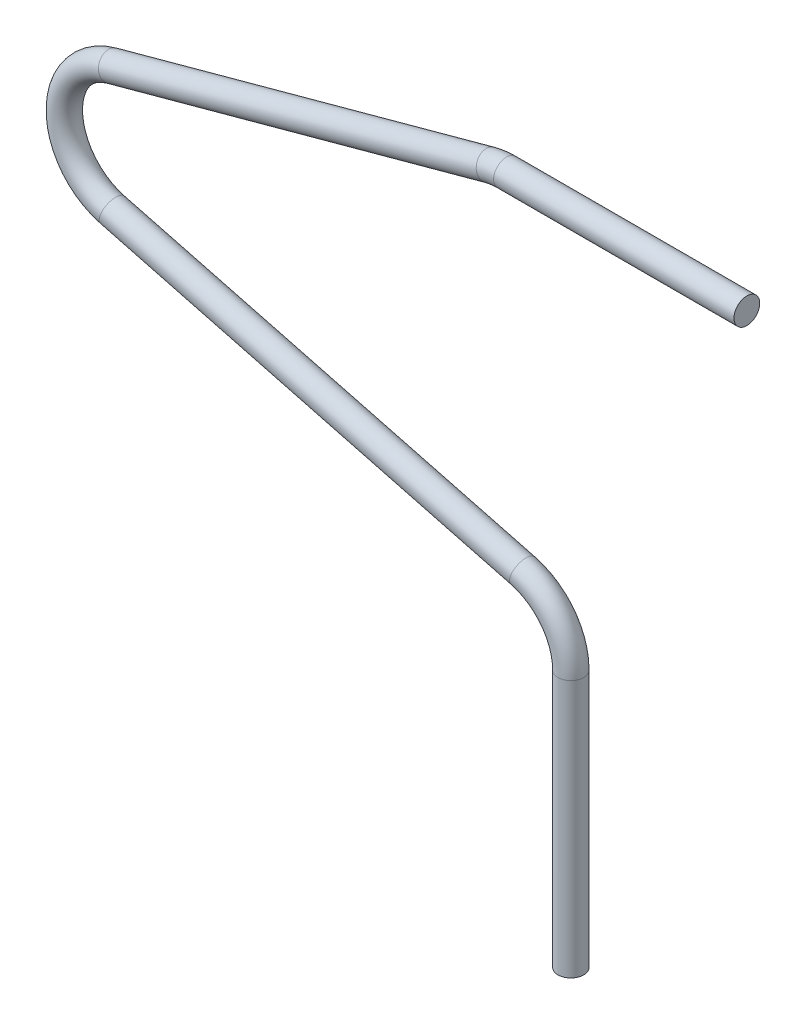
ISO-10303-21;
HEADER;
FILE_DESCRIPTION(('STEP AP214'),'2;1');
FILE_NAME('part.step','',(''),(''),'','','');
FILE_SCHEMA(('AUTOMOTIVE_DESIGN { 1 0 10303 214 1 1 1 1 }'));
ENDSEC;
DATA;
#1=APPLICATION_CONTEXT('core data for automotive mechanical design processes');
#2=APPLICATION_PROTOCOL_DEFINITION('international standard','automotive_design',2000,#1);
#3=PRODUCT_CONTEXT('',#1,'mechanical');
#4=PRODUCT('Part','Part','',(#3));
#5=PRODUCT_RELATED_PRODUCT_CATEGORY('part','',(#4));
#6=PRODUCT_DEFINITION_FORMATION('','',#4);
#7=PRODUCT_DEFINITION_CONTEXT('part definition',#1,'design');
#8=PRODUCT_DEFINITION('design','',#6,#7);
#9=PRODUCT_DEFINITION_SHAPE('','',#8);
#10=(LENGTH_UNIT() NAMED_UNIT(*) SI_UNIT(.MILLI.,.METRE.));
#11=(NAMED_UNIT(*) PLANE_ANGLE_UNIT() SI_UNIT($,.RADIAN.));
#12=(NAMED_UNIT(*) SI_UNIT($,.STERADIAN.) SOLID_ANGLE_UNIT());
#13=UNCERTAINTY_MEASURE_WITH_UNIT(LENGTH_MEASURE(1.E-05),#10,'distance_accuracy_value','');
#14=(GEOMETRIC_REPRESENTATION_CONTEXT(3) GLOBAL_UNCERTAINTY_ASSIGNED_CONTEXT((#13)) GLOBAL_UNIT_ASSIGNED_CONTEXT((#10,
#11,#12)) REPRESENTATION_CONTEXT('',''));
#15=CARTESIAN_POINT('',(0.,0.,0.));
#16=DIRECTION('',(0.,0.,1.));
#17=DIRECTION('',(1.,0.,0.));
#18=AXIS2_PLACEMENT_3D('',#15,#16,#17);
#19=CARTESIAN_POINT('',(-3.75000000000001,38.25,0.));
#20=DIRECTION('',(1.,0.,0.));
#21=DIRECTION('',(0.,0.,-1.));
#22=AXIS2_PLACEMENT_3D('',#19,#20,#21);
#23=CYLINDRICAL_SURFACE('',#22,0.75);
#24=CARTESIAN_POINT('',(-3.75000000000001,38.25,0.));
#25=DIRECTION('',(1.,0.,0.));
#26=DIRECTION('',(0.,0.,1.));
#27=AXIS2_PLACEMENT_3D('',#24,#25,#26);
#28=CIRCLE('',#27,0.75);
#29=CARTESIAN_POINT('',(-3.75000000000001,39.,0.));
#30=VERTEX_POINT('',#29);
#31=EDGE_CURVE('E38',#30,#30,#28,.T.);
#32=ORIENTED_EDGE('',*,*,#31,.T.);
#33=EDGE_LOOP('',(#32));
#34=FACE_BOUND('',#33,.T.);
#35=CARTESIAN_POINT('',(10.25,38.25,0.));
#36=DIRECTION('',(1.,0.,0.));
#37=DIRECTION('',(0.,0.,1.));
#38=AXIS2_PLACEMENT_3D('',#35,#36,#37);
#39=CIRCLE('',#38,0.75);
#40=CARTESIAN_POINT('',(10.25,38.25,0.75));
#41=VERTEX_POINT('',#40);
#42=EDGE_CURVE('E10',#41,#41,#39,.T.);
#43=ORIENTED_EDGE('',*,*,#42,.F.);
#44=EDGE_LOOP('',(#43));
#45=FACE_BOUND('',#44,.T.);
#46=ADVANCED_FACE('F32',(#34,#45),#23,.T.);
#47=CARTESIAN_POINT('',(-3.75,34.5,0.));
#48=DIRECTION('',(0.,0.,-1.));
#49=DIRECTION('',(-1.,0.,0.));
#50=AXIS2_PLACEMENT_3D('',#47,#48,#49);
#51=TOROIDAL_SURFACE('',#50,3.75000000000001,0.75);
#52=CARTESIAN_POINT('',(-4.73669027172042,38.1178643296415,0.));
#53=DIRECTION('',(0.964763821237732,0.26311740579211,0.));
#54=DIRECTION('',(0.,0.,1.));
#55=AXIS2_PLACEMENT_3D('',#52,#53,#54);
#56=CIRCLE('',#55,0.75);
#57=CARTESIAN_POINT('',(-4.9340283260645,38.8414371955698,0.));
#58=VERTEX_POINT('',#57);
#59=EDGE_CURVE('E42',#58,#58,#56,.T.);
#60=CARTESIAN_POINT('',(-3.75,34.5,0.));
#61=DIRECTION('',(0.,0.,-1.));
#62=DIRECTION('',(-1.,0.,0.));
#63=AXIS2_PLACEMENT_3D('',#60,#61,#62);
#64=CIRCLE('',#63,4.50000000000001);
#65=EDGE_CURVE('',#58,#30,#64,.T.);
#66=ORIENTED_EDGE('',*,*,#59,.T.);
#67=ORIENTED_EDGE('',*,*,#31,.F.);
#68=ORIENTED_EDGE('',*,*,#65,.T.);
#69=ORIENTED_EDGE('',*,*,#65,.F.);
#70=EDGE_LOOP('',(#66,#68,#67,#69));
#71=FACE_BOUND('',#70,.T.);
#72=ADVANCED_FACE('F82',(#71),#51,.T.);
#73=CARTESIAN_POINT('',(-26.7366902717204,32.1178643296415,0.));
#74=DIRECTION('',(0.964763821237732,0.263117405792109,0.));
#75=DIRECTION('',(-0.263117405792109,0.964763821237732,0.));
#76=AXIS2_PLACEMENT_3D('',#73,#74,#75);
#77=CYLINDRICAL_SURFACE('',#76,0.75);
#78=CARTESIAN_POINT('',(-26.7366902717204,32.1178643296415,0.));
#79=DIRECTION('',(0.964763821237732,0.26311740579211,0.));
#80=DIRECTION('',(0.,0.,1.));
#81=AXIS2_PLACEMENT_3D('',#78,#79,#80);
#82=CIRCLE('',#81,0.75);
#83=CARTESIAN_POINT('',(-26.9340283260645,32.8414371955698,0.));
#84=VERTEX_POINT('',#83);
#85=EDGE_CURVE('E46',#84,#84,#82,.T.);
#86=ORIENTED_EDGE('',*,*,#85,.T.);
#87=EDGE_LOOP('',(#86));
#88=FACE_BOUND('',#87,.T.);
#89=ORIENTED_EDGE('',*,*,#59,.F.);
#90=EDGE_LOOP('',(#89));
#91=FACE_BOUND('',#90,.T.);
#92=ADVANCED_FACE('F86',(#88,#91),#77,.T.);
#93=CARTESIAN_POINT('',(-25.75,28.5,0.));
#94=DIRECTION('',(0.,0.,-1.));
#95=DIRECTION('',(-1.,0.,0.));
#96=AXIS2_PLACEMENT_3D('',#93,#94,#95);
#97=TOROIDAL_SURFACE('',#96,3.75000000000001,0.75);
#98=CARTESIAN_POINT('',(-26.6979853880929,24.8718015897746,0.));
#99=DIRECTION('',(-0.967519576060117,0.252796103491435,0.));
#100=DIRECTION('',(0.,0.,1.));
#101=AXIS2_PLACEMENT_3D('',#98,#99,#100);
#102=CIRCLE('',#101,0.75);
#103=CARTESIAN_POINT('',(-26.8875824657115,24.1461619077295,0.));
#104=VERTEX_POINT('',#103);
#105=EDGE_CURVE('E51',#104,#104,#102,.T.);
#106=CARTESIAN_POINT('',(-25.75,28.5,0.));
#107=DIRECTION('',(0.,0.,-1.));
#108=DIRECTION('',(-1.,0.,0.));
#109=AXIS2_PLACEMENT_3D('',#106,#107,#108);
#110=CIRCLE('',#109,4.50000000000001);
#111=EDGE_CURVE('',#104,#84,#110,.T.);
#112=ORIENTED_EDGE('',*,*,#105,.T.);
#113=ORIENTED_EDGE('',*,*,#85,.F.);
#114=ORIENTED_EDGE('',*,*,#111,.T.);
#115=ORIENTED_EDGE('',*,*,#111,.F.);
#116=EDGE_LOOP('',(#112,#114,#113,#115));
#117=FACE_BOUND('',#116,.T.);
#118=ADVANCED_FACE('F92',(#117),#97,.T.);
#119=CARTESIAN_POINT('',(-2.80201461190712,18.6281984102254,0.));
#120=DIRECTION('',(-0.967519576060117,0.252796103491435,0.));
#121=DIRECTION('',(-0.252796103491435,-0.967519576060117,0.));
#122=AXIS2_PLACEMENT_3D('',#119,#120,#121);
#123=CYLINDRICAL_SURFACE('',#122,0.75);
#124=CARTESIAN_POINT('',(-2.80201461190712,18.6281984102254,0.));
#125=DIRECTION('',(-0.967519576060117,0.252796103491435,0.));
#126=DIRECTION('',(0.,0.,1.));
#127=AXIS2_PLACEMENT_3D('',#124,#125,#126);
#128=CIRCLE('',#127,0.75);
#129=CARTESIAN_POINT('',(-2.61241753428854,19.3538380922705,0.));
#130=VERTEX_POINT('',#129);
#131=EDGE_CURVE('E54',#130,#130,#128,.T.);
#132=ORIENTED_EDGE('',*,*,#131,.T.);
#133=EDGE_LOOP('',(#132));
#134=FACE_BOUND('',#133,.T.);
#135=ORIENTED_EDGE('',*,*,#105,.F.);
#136=EDGE_LOOP('',(#135));
#137=FACE_BOUND('',#136,.T.);
#138=ADVANCED_FACE('F99',(#134,#137),#123,.T.);
#139=CARTESIAN_POINT('',(-3.75,15.,0.));
#140=DIRECTION('',(0.,0.,1.));
#141=DIRECTION('',(1.,0.,0.));
#142=AXIS2_PLACEMENT_3D('',#139,#140,#141);
#143=TOROIDAL_SURFACE('',#142,3.75,0.75);
#144=CARTESIAN_POINT('',(0.,15.,0.));
#145=DIRECTION('',(0.,1.,0.));
#146=DIRECTION('',(0.,0.,1.));
#147=AXIS2_PLACEMENT_3D('',#144,#145,#146);
#148=CIRCLE('',#147,0.75);
#149=CARTESIAN_POINT('',(0.75,15.,0.));
#150=VERTEX_POINT('',#149);
#151=EDGE_CURVE('E57',#150,#150,#148,.T.);
#152=CARTESIAN_POINT('',(-3.75,15.,0.));
#153=DIRECTION('',(0.,0.,1.));
#154=DIRECTION('',(1.,0.,0.));
#155=AXIS2_PLACEMENT_3D('',#152,#153,#154);
#156=CIRCLE('',#155,4.5);
#157=EDGE_CURVE('',#150,#130,#156,.T.);
#158=ORIENTED_EDGE('',*,*,#151,.T.);
#159=ORIENTED_EDGE('',*,*,#131,.F.);
#160=ORIENTED_EDGE('',*,*,#157,.T.);
#161=ORIENTED_EDGE('',*,*,#157,.F.);
#162=EDGE_LOOP('',(#158,#160,#159,#161));
#163=FACE_BOUND('',#162,.T.);
#164=ADVANCED_FACE('F64',(#163),#143,.T.);
#165=CARTESIAN_POINT('',(0.,15.,0.));
#166=DIRECTION('',(0.,-1.,0.));
#167=DIRECTION('',(0.,0.,-1.));
#168=AXIS2_PLACEMENT_3D('',#165,#166,#167);
#169=CYLINDRICAL_SURFACE('',#168,0.75);
#170=ORIENTED_EDGE('',*,*,#151,.F.);
#171=EDGE_LOOP('',(#170));
#172=FACE_BOUND('',#171,.T.);
#173=CARTESIAN_POINT('',(0.,0.,0.));
#174=DIRECTION('',(0.,1.,0.));
#175=DIRECTION('',(0.,0.,1.));
#176=AXIS2_PLACEMENT_3D('',#173,#174,#175);
#177=CIRCLE('',#176,0.75);
#178=CARTESIAN_POINT('',(0.,0.,0.75));
#179=VERTEX_POINT('',#178);
#180=EDGE_CURVE('E58',#179,#179,#177,.T.);
#181=ORIENTED_EDGE('',*,*,#180,.T.);
#182=EDGE_LOOP('',(#181));
#183=FACE_BOUND('',#182,.T.);
#184=ADVANCED_FACE('F67',(#172,#183),#169,.T.);
#185=CARTESIAN_POINT('',(10.25,38.25,0.));
#186=DIRECTION('',(1.,0.,0.));
#187=DIRECTION('',(0.,0.,1.));
#188=AXIS2_PLACEMENT_3D('',#185,#186,#187);
#189=PLANE('',#188);
#190=ORIENTED_EDGE('',*,*,#42,.T.);
#191=EDGE_LOOP('',(#190));
#192=FACE_BOUND('',#191,.T.);
#193=ADVANCED_FACE('F70',(#192),#189,.T.);
#194=CARTESIAN_POINT('',(0.,0.,0.));
#195=DIRECTION('',(0.,1.,0.));
#196=DIRECTION('',(0.,0.,1.));
#197=AXIS2_PLACEMENT_3D('',#194,#195,#196);
#198=PLANE('',#197);
#199=ORIENTED_EDGE('',*,*,#180,.F.);
#200=EDGE_LOOP('',(#199));
#201=FACE_BOUND('',#200,.T.);
#202=ADVANCED_FACE('F74',(#201),#198,.F.);
#203=CLOSED_SHELL('',(#46,#72,#92,#118,#138,#164,#184,#193,#202));
#204=MANIFOLD_SOLID_BREP('B2',#203);
#205=ADVANCED_BREP_SHAPE_REPRESENTATION('',(#18,#204),#14);
#206=SHAPE_DEFINITION_REPRESENTATION(#9,#205);
ENDSEC;
END-ISO-10303-21;
